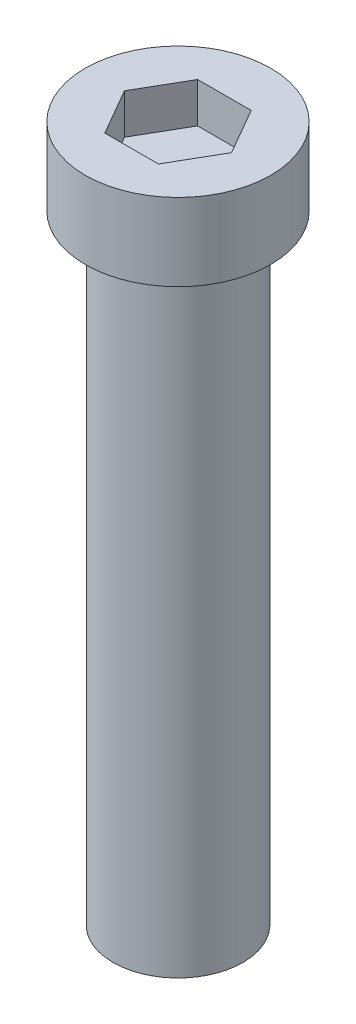
ISO-10303-21;
HEADER;
FILE_DESCRIPTION(('STEP AP214'),'2;1');
FILE_NAME('part.step','',(''),(''),'','','');
FILE_SCHEMA(('AUTOMOTIVE_DESIGN { 1 0 10303 214 1 1 1 1 }'));
ENDSEC;
DATA;
#1=APPLICATION_CONTEXT('core data for automotive mechanical design processes');
#2=APPLICATION_PROTOCOL_DEFINITION('international standard','automotive_design',2000,#1);
#3=PRODUCT_CONTEXT('',#1,'mechanical');
#4=PRODUCT('Part','Part','',(#3));
#5=PRODUCT_RELATED_PRODUCT_CATEGORY('part','',(#4));
#6=PRODUCT_DEFINITION_FORMATION('','',#4);
#7=PRODUCT_DEFINITION_CONTEXT('part definition',#1,'design');
#8=PRODUCT_DEFINITION('design','',#6,#7);
#9=PRODUCT_DEFINITION_SHAPE('','',#8);
#10=(LENGTH_UNIT() NAMED_UNIT(*) SI_UNIT(.MILLI.,.METRE.));
#11=(NAMED_UNIT(*) PLANE_ANGLE_UNIT() SI_UNIT($,.RADIAN.));
#12=(NAMED_UNIT(*) SI_UNIT($,.STERADIAN.) SOLID_ANGLE_UNIT());
#13=UNCERTAINTY_MEASURE_WITH_UNIT(LENGTH_MEASURE(1.E-05),#10,'distance_accuracy_value','');
#14=(GEOMETRIC_REPRESENTATION_CONTEXT(3) GLOBAL_UNCERTAINTY_ASSIGNED_CONTEXT((#13)) GLOBAL_UNIT_ASSIGNED_CONTEXT((#10,
#11,#12)) REPRESENTATION_CONTEXT('',''));
#15=CARTESIAN_POINT('',(0.,0.,0.));
#16=DIRECTION('',(0.,0.,1.));
#17=DIRECTION('',(1.,0.,0.));
#18=AXIS2_PLACEMENT_3D('',#15,#16,#17);
#19=CARTESIAN_POINT('',(0.,2.5,0.));
#20=DIRECTION('',(0.,-1.,0.));
#21=DIRECTION('',(0.,0.,-1.));
#22=AXIS2_PLACEMENT_3D('',#19,#20,#21);
#23=CYLINDRICAL_SURFACE('',#22,3.);
#24=CARTESIAN_POINT('',(0.,2.5,0.));
#25=DIRECTION('',(0.,1.,0.));
#26=DIRECTION('',(0.,0.,1.));
#27=AXIS2_PLACEMENT_3D('',#24,#25,#26);
#28=CIRCLE('',#27,3.);
#29=CARTESIAN_POINT('',(0.,2.5,3.));
#30=VERTEX_POINT('',#29);
#31=EDGE_CURVE('E134',#30,#30,#28,.T.);
#32=ORIENTED_EDGE('',*,*,#31,.F.);
#33=EDGE_LOOP('',(#32));
#34=FACE_BOUND('',#33,.T.);
#35=CARTESIAN_POINT('',(0.,0.,0.));
#36=DIRECTION('',(0.,1.,0.));
#37=DIRECTION('',(0.,0.,1.));
#38=AXIS2_PLACEMENT_3D('',#35,#36,#37);
#39=CIRCLE('',#38,3.);
#40=CARTESIAN_POINT('',(0.,0.,3.));
#41=VERTEX_POINT('',#40);
#42=EDGE_CURVE('E131',#41,#41,#39,.T.);
#43=ORIENTED_EDGE('',*,*,#42,.T.);
#44=EDGE_LOOP('',(#43));
#45=FACE_BOUND('',#44,.T.);
#46=ADVANCED_FACE('F36',(#34,#45),#23,.T.);
#47=CARTESIAN_POINT('',(0.,2.5,0.));
#48=DIRECTION('',(0.,1.,0.));
#49=DIRECTION('',(0.,0.,1.));
#50=AXIS2_PLACEMENT_3D('',#47,#48,#49);
#51=PLANE('',#50);
#52=DIRECTION('',(0.5,0.,-0.866025403784439));
#53=VECTOR('',#52,1.);
#54=CARTESIAN_POINT('',(1.29903810567666,2.5,0.749999999999999));
#55=LINE('',#54,#53);
#56=CARTESIAN_POINT('',(0.866025403784439,2.5,1.5));
#57=VERTEX_POINT('',#56);
#58=CARTESIAN_POINT('',(1.73205080756888,2.5,0.));
#59=VERTEX_POINT('',#58);
#60=EDGE_CURVE('E11',#57,#59,#55,.T.);
#61=ORIENTED_EDGE('',*,*,#60,.F.);
#62=DIRECTION('',(1.,0.,0.));
#63=VECTOR('',#62,1.);
#64=CARTESIAN_POINT('',(0.,2.5,1.5));
#65=LINE('',#64,#63);
#66=CARTESIAN_POINT('',(-0.866025403784439,2.5,1.5));
#67=VERTEX_POINT('',#66);
#68=EDGE_CURVE('E43',#67,#57,#65,.T.);
#69=ORIENTED_EDGE('',*,*,#68,.F.);
#70=DIRECTION('',(0.5,0.,0.866025403784439));
#71=VECTOR('',#70,1.);
#72=CARTESIAN_POINT('',(-1.29903810567666,2.5,0.75));
#73=LINE('',#72,#71);
#74=CARTESIAN_POINT('',(-1.73205080756888,2.5,0.));
#75=VERTEX_POINT('',#74);
#76=EDGE_CURVE('E145',#75,#67,#73,.T.);
#77=ORIENTED_EDGE('',*,*,#76,.F.);
#78=DIRECTION('',(-0.5,0.,0.866025403784439));
#79=VECTOR('',#78,1.);
#80=CARTESIAN_POINT('',(-1.29903810567666,2.5,-0.75));
#81=LINE('',#80,#79);
#82=CARTESIAN_POINT('',(-0.866025403784439,2.5,-1.5));
#83=VERTEX_POINT('',#82);
#84=EDGE_CURVE('E143',#83,#75,#81,.T.);
#85=ORIENTED_EDGE('',*,*,#84,.F.);
#86=DIRECTION('',(-1.,0.,0.));
#87=VECTOR('',#86,1.);
#88=CARTESIAN_POINT('',(0.,2.5,-1.5));
#89=LINE('',#88,#87);
#90=CARTESIAN_POINT('',(0.866025403784438,2.5,-1.5));
#91=VERTEX_POINT('',#90);
#92=EDGE_CURVE('E141',#91,#83,#89,.T.);
#93=ORIENTED_EDGE('',*,*,#92,.F.);
#94=DIRECTION('',(-0.5,0.,-0.866025403784439));
#95=VECTOR('',#94,1.);
#96=CARTESIAN_POINT('',(1.29903810567666,2.5,-0.75));
#97=LINE('',#96,#95);
#98=EDGE_CURVE('E137',#59,#91,#97,.T.);
#99=ORIENTED_EDGE('',*,*,#98,.F.);
#100=EDGE_LOOP('',(#61,#69,#77,#85,#93,#99));
#101=FACE_BOUND('',#100,.T.);
#102=ORIENTED_EDGE('',*,*,#31,.T.);
#103=EDGE_LOOP('',(#102));
#104=FACE_BOUND('',#103,.T.);
#105=ADVANCED_FACE('F153',(#101,#104),#51,.T.);
#106=CARTESIAN_POINT('',(0.,0.,0.));
#107=DIRECTION('',(0.,1.,0.));
#108=DIRECTION('',(0.,0.,1.));
#109=AXIS2_PLACEMENT_3D('',#106,#107,#108);
#110=PLANE('',#109);
#111=CARTESIAN_POINT('',(0.,0.,0.));
#112=DIRECTION('',(0.,1.,0.));
#113=DIRECTION('',(0.,0.,1.));
#114=AXIS2_PLACEMENT_3D('',#111,#112,#113);
#115=CIRCLE('',#114,2.1);
#116=CARTESIAN_POINT('',(0.,0.,2.1));
#117=VERTEX_POINT('',#116);
#118=EDGE_CURVE('E118',#117,#117,#115,.T.);
#119=ORIENTED_EDGE('',*,*,#118,.T.);
#120=EDGE_LOOP('',(#119));
#121=FACE_BOUND('',#120,.T.);
#122=ORIENTED_EDGE('',*,*,#42,.F.);
#123=EDGE_LOOP('',(#122));
#124=FACE_BOUND('',#123,.T.);
#125=ADVANCED_FACE('F174',(#121,#124),#110,.F.);
#126=CARTESIAN_POINT('',(0.,-20.,0.));
#127=DIRECTION('',(0.,1.,0.));
#128=DIRECTION('',(0.,0.,1.));
#129=AXIS2_PLACEMENT_3D('',#126,#127,#128);
#130=CYLINDRICAL_SURFACE('',#129,2.1);
#131=CARTESIAN_POINT('',(0.,-20.,0.));
#132=DIRECTION('',(0.,1.,0.));
#133=DIRECTION('',(0.,0.,1.));
#134=AXIS2_PLACEMENT_3D('',#131,#132,#133);
#135=CIRCLE('',#134,2.1);
#136=CARTESIAN_POINT('',(0.,-20.,2.1));
#137=VERTEX_POINT('',#136);
#138=EDGE_CURVE('E128',#137,#137,#135,.T.);
#139=ORIENTED_EDGE('',*,*,#138,.T.);
#140=EDGE_LOOP('',(#139));
#141=FACE_BOUND('',#140,.T.);
#142=ORIENTED_EDGE('',*,*,#118,.F.);
#143=EDGE_LOOP('',(#142));
#144=FACE_BOUND('',#143,.T.);
#145=ADVANCED_FACE('F181',(#141,#144),#130,.T.);
#146=CARTESIAN_POINT('',(0.,-20.,0.));
#147=DIRECTION('',(0.,1.,0.));
#148=DIRECTION('',(0.,0.,1.));
#149=AXIS2_PLACEMENT_3D('',#146,#147,#148);
#150=PLANE('',#149);
#151=ORIENTED_EDGE('',*,*,#138,.F.);
#152=EDGE_LOOP('',(#151));
#153=FACE_BOUND('',#152,.T.);
#154=ADVANCED_FACE('F186',(#153),#150,.F.);
#155=CARTESIAN_POINT('',(0.866025403784439,1.2,1.5));
#156=DIRECTION('',(0.866025403784439,0.,0.5));
#157=DIRECTION('',(0.5,0.,-0.866025403784439));
#158=AXIS2_PLACEMENT_3D('',#155,#156,#157);
#159=PLANE('',#158);
#160=ORIENTED_EDGE('',*,*,#60,.T.);
#161=DIRECTION('',(0.,1.,0.));
#162=VECTOR('',#161,1.);
#163=CARTESIAN_POINT('',(1.73205080756888,1.2,0.));
#164=LINE('',#163,#162);
#165=CARTESIAN_POINT('',(1.73205080756888,1.2,0.));
#166=VERTEX_POINT('',#165);
#167=EDGE_CURVE('E50',#166,#59,#164,.T.);
#168=ORIENTED_EDGE('',*,*,#167,.F.);
#169=DIRECTION('',(0.5,0.,-0.866025403784439));
#170=VECTOR('',#169,1.);
#171=CARTESIAN_POINT('',(0.866025403784439,1.2,1.5));
#172=LINE('',#171,#170);
#173=CARTESIAN_POINT('',(0.866025403784439,1.2,1.5));
#174=VERTEX_POINT('',#173);
#175=EDGE_CURVE('E88',#174,#166,#172,.T.);
#176=ORIENTED_EDGE('',*,*,#175,.F.);
#177=DIRECTION('',(0.,1.,0.));
#178=VECTOR('',#177,1.);
#179=CARTESIAN_POINT('',(0.866025403784439,1.2,1.5));
#180=LINE('',#179,#178);
#181=EDGE_CURVE('E116',#174,#57,#180,.T.);
#182=ORIENTED_EDGE('',*,*,#181,.T.);
#183=EDGE_LOOP('',(#160,#168,#176,#182));
#184=FACE_BOUND('',#183,.T.);
#185=ADVANCED_FACE('F86',(#184),#159,.F.);
#186=CARTESIAN_POINT('',(-0.866025403784439,1.2,1.5));
#187=DIRECTION('',(0.,0.,1.));
#188=DIRECTION('',(1.,0.,0.));
#189=AXIS2_PLACEMENT_3D('',#186,#187,#188);
#190=PLANE('',#189);
#191=ORIENTED_EDGE('',*,*,#68,.T.);
#192=ORIENTED_EDGE('',*,*,#181,.F.);
#193=DIRECTION('',(1.,0.,0.));
#194=VECTOR('',#193,1.);
#195=CARTESIAN_POINT('',(-0.866025403784439,1.2,1.5));
#196=LINE('',#195,#194);
#197=CARTESIAN_POINT('',(-0.866025403784439,1.2,1.5));
#198=VERTEX_POINT('',#197);
#199=EDGE_CURVE('E93',#198,#174,#196,.T.);
#200=ORIENTED_EDGE('',*,*,#199,.F.);
#201=DIRECTION('',(0.,1.,0.));
#202=VECTOR('',#201,1.);
#203=CARTESIAN_POINT('',(-0.866025403784439,1.2,1.5));
#204=LINE('',#203,#202);
#205=EDGE_CURVE('E119',#198,#67,#204,.T.);
#206=ORIENTED_EDGE('',*,*,#205,.T.);
#207=EDGE_LOOP('',(#191,#192,#200,#206));
#208=FACE_BOUND('',#207,.T.);
#209=ADVANCED_FACE('F152',(#208),#190,.F.);
#210=CARTESIAN_POINT('',(-1.73205080756888,1.2,0.));
#211=DIRECTION('',(-0.866025403784439,0.,0.5));
#212=DIRECTION('',(0.5,0.,0.866025403784439));
#213=AXIS2_PLACEMENT_3D('',#210,#211,#212);
#214=PLANE('',#213);
#215=ORIENTED_EDGE('',*,*,#76,.T.);
#216=ORIENTED_EDGE('',*,*,#205,.F.);
#217=DIRECTION('',(0.5,0.,0.866025403784439));
#218=VECTOR('',#217,1.);
#219=CARTESIAN_POINT('',(-1.73205080756888,1.2,0.));
#220=LINE('',#219,#218);
#221=CARTESIAN_POINT('',(-1.73205080756888,1.2,0.));
#222=VERTEX_POINT('',#221);
#223=EDGE_CURVE('E113',#222,#198,#220,.T.);
#224=ORIENTED_EDGE('',*,*,#223,.F.);
#225=DIRECTION('',(0.,1.,0.));
#226=VECTOR('',#225,1.);
#227=CARTESIAN_POINT('',(-1.73205080756888,1.2,0.));
#228=LINE('',#227,#226);
#229=EDGE_CURVE('E121',#222,#75,#228,.T.);
#230=ORIENTED_EDGE('',*,*,#229,.T.);
#231=EDGE_LOOP('',(#215,#216,#224,#230));
#232=FACE_BOUND('',#231,.T.);
#233=ADVANCED_FACE('F148',(#232),#214,.F.);
#234=CARTESIAN_POINT('',(-0.866025403784439,1.2,-1.5));
#235=DIRECTION('',(-0.866025403784439,0.,-0.5));
#236=DIRECTION('',(-0.5,0.,0.866025403784439));
#237=AXIS2_PLACEMENT_3D('',#234,#235,#236);
#238=PLANE('',#237);
#239=ORIENTED_EDGE('',*,*,#84,.T.);
#240=ORIENTED_EDGE('',*,*,#229,.F.);
#241=DIRECTION('',(-0.5,0.,0.866025403784439));
#242=VECTOR('',#241,1.);
#243=CARTESIAN_POINT('',(-0.866025403784439,1.2,-1.5));
#244=LINE('',#243,#242);
#245=CARTESIAN_POINT('',(-0.866025403784439,1.2,-1.5));
#246=VERTEX_POINT('',#245);
#247=EDGE_CURVE('E110',#246,#222,#244,.T.);
#248=ORIENTED_EDGE('',*,*,#247,.F.);
#249=DIRECTION('',(0.,1.,0.));
#250=VECTOR('',#249,1.);
#251=CARTESIAN_POINT('',(-0.866025403784439,1.2,-1.5));
#252=LINE('',#251,#250);
#253=EDGE_CURVE('E124',#246,#83,#252,.T.);
#254=ORIENTED_EDGE('',*,*,#253,.T.);
#255=EDGE_LOOP('',(#239,#240,#248,#254));
#256=FACE_BOUND('',#255,.T.);
#257=ADVANCED_FACE('F160',(#256),#238,.F.);
#258=CARTESIAN_POINT('',(0.866025403784438,1.2,-1.5));
#259=DIRECTION('',(0.,0.,-1.));
#260=DIRECTION('',(-1.,0.,0.));
#261=AXIS2_PLACEMENT_3D('',#258,#259,#260);
#262=PLANE('',#261);
#263=ORIENTED_EDGE('',*,*,#92,.T.);
#264=ORIENTED_EDGE('',*,*,#253,.F.);
#265=DIRECTION('',(-1.,0.,0.));
#266=VECTOR('',#265,1.);
#267=CARTESIAN_POINT('',(0.866025403784438,1.2,-1.5));
#268=LINE('',#267,#266);
#269=CARTESIAN_POINT('',(0.866025403784438,1.2,-1.5));
#270=VERTEX_POINT('',#269);
#271=EDGE_CURVE('E102',#270,#246,#268,.T.);
#272=ORIENTED_EDGE('',*,*,#271,.F.);
#273=DIRECTION('',(0.,1.,0.));
#274=VECTOR('',#273,1.);
#275=CARTESIAN_POINT('',(0.866025403784438,1.2,-1.5));
#276=LINE('',#275,#274);
#277=EDGE_CURVE('E92',#270,#91,#276,.T.);
#278=ORIENTED_EDGE('',*,*,#277,.T.);
#279=EDGE_LOOP('',(#263,#264,#272,#278));
#280=FACE_BOUND('',#279,.T.);
#281=ADVANCED_FACE('F157',(#280),#262,.F.);
#282=CARTESIAN_POINT('',(1.73205080756888,1.2,0.));
#283=DIRECTION('',(0.866025403784439,0.,-0.5));
#284=DIRECTION('',(-0.5,0.,-0.866025403784439));
#285=AXIS2_PLACEMENT_3D('',#282,#283,#284);
#286=PLANE('',#285);
#287=ORIENTED_EDGE('',*,*,#98,.T.);
#288=ORIENTED_EDGE('',*,*,#277,.F.);
#289=DIRECTION('',(-0.5,0.,-0.866025403784439));
#290=VECTOR('',#289,1.);
#291=CARTESIAN_POINT('',(1.73205080756888,1.2,0.));
#292=LINE('',#291,#290);
#293=EDGE_CURVE('E96',#166,#270,#292,.T.);
#294=ORIENTED_EDGE('',*,*,#293,.F.);
#295=ORIENTED_EDGE('',*,*,#167,.T.);
#296=EDGE_LOOP('',(#287,#288,#294,#295));
#297=FACE_BOUND('',#296,.T.);
#298=ADVANCED_FACE('F97',(#297),#286,.F.);
#299=CARTESIAN_POINT('',(0.,1.2,0.));
#300=DIRECTION('',(0.,1.,0.));
#301=DIRECTION('',(0.,0.,1.));
#302=AXIS2_PLACEMENT_3D('',#299,#300,#301);
#303=PLANE('',#302);
#304=ORIENTED_EDGE('',*,*,#175,.T.);
#305=ORIENTED_EDGE('',*,*,#293,.T.);
#306=ORIENTED_EDGE('',*,*,#271,.T.);
#307=ORIENTED_EDGE('',*,*,#247,.T.);
#308=ORIENTED_EDGE('',*,*,#223,.T.);
#309=ORIENTED_EDGE('',*,*,#199,.T.);
#310=EDGE_LOOP('',(#304,#305,#306,#307,#308,#309));
#311=FACE_BOUND('',#310,.T.);
#312=ADVANCED_FACE('F104',(#311),#303,.T.);
#313=CLOSED_SHELL('',(#46,#105,#125,#145,#154,#185,#209,#233,#257,#281,#298,#312));
#314=MANIFOLD_SOLID_BREP('B2',#313);
#315=ADVANCED_BREP_SHAPE_REPRESENTATION('',(#18,#314),#14);
#316=SHAPE_DEFINITION_REPRESENTATION(#9,#315);
ENDSEC;
END-ISO-10303-21;
